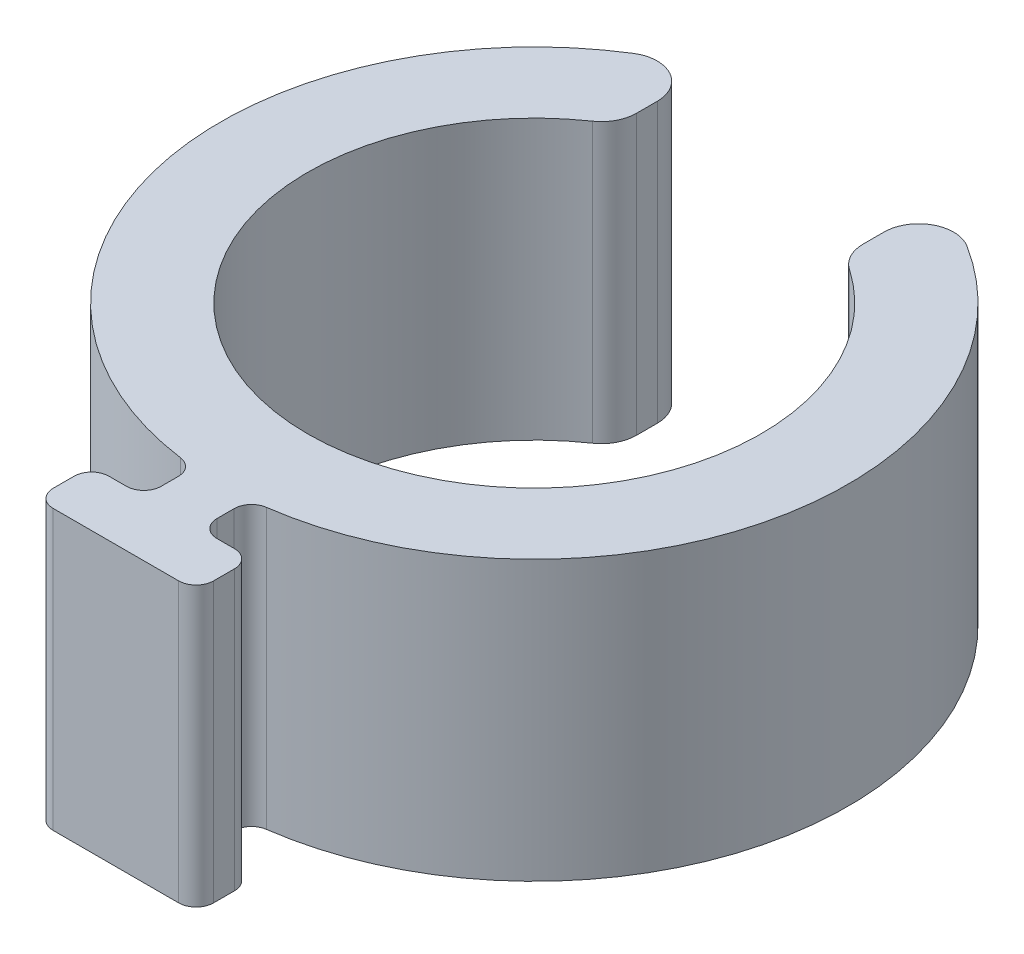
ISO-10303-21;
HEADER;
FILE_DESCRIPTION(('STEP AP214'),'2;1');
FILE_NAME('part.step','',(''),(''),'','','');
FILE_SCHEMA(('AUTOMOTIVE_DESIGN { 1 0 10303 214 1 1 1 1 }'));
ENDSEC;
DATA;
#1=APPLICATION_CONTEXT('core data for automotive mechanical design processes');
#2=APPLICATION_PROTOCOL_DEFINITION('international standard','automotive_design',2000,#1);
#3=PRODUCT_CONTEXT('',#1,'mechanical');
#4=PRODUCT('Part','Part','',(#3));
#5=PRODUCT_RELATED_PRODUCT_CATEGORY('part','',(#4));
#6=PRODUCT_DEFINITION_FORMATION('','',#4);
#7=PRODUCT_DEFINITION_CONTEXT('part definition',#1,'design');
#8=PRODUCT_DEFINITION('design','',#6,#7);
#9=PRODUCT_DEFINITION_SHAPE('','',#8);
#10=(LENGTH_UNIT() NAMED_UNIT(*) SI_UNIT(.MILLI.,.METRE.));
#11=(NAMED_UNIT(*) PLANE_ANGLE_UNIT() SI_UNIT($,.RADIAN.));
#12=(NAMED_UNIT(*) SI_UNIT($,.STERADIAN.) SOLID_ANGLE_UNIT());
#13=UNCERTAINTY_MEASURE_WITH_UNIT(LENGTH_MEASURE(1.E-05),#10,'distance_accuracy_value','');
#14=(GEOMETRIC_REPRESENTATION_CONTEXT(3) GLOBAL_UNCERTAINTY_ASSIGNED_CONTEXT((#13)) GLOBAL_UNIT_ASSIGNED_CONTEXT((#10,
#11,#12)) REPRESENTATION_CONTEXT('',''));
#15=CARTESIAN_POINT('',(0.,0.,0.));
#16=DIRECTION('',(0.,0.,1.));
#17=DIRECTION('',(1.,0.,0.));
#18=AXIS2_PLACEMENT_3D('',#15,#16,#17);
#19=CARTESIAN_POINT('',(0.,8.,0.));
#20=DIRECTION('',(0.,-1.,0.));
#21=DIRECTION('',(0.,0.,-1.));
#22=AXIS2_PLACEMENT_3D('',#19,#20,#21);
#23=CYLINDRICAL_SURFACE('',#22,9.);
#24=CARTESIAN_POINT('',(0.,0.,0.));
#25=DIRECTION('',(0.,1.,0.));
#26=DIRECTION('',(0.,0.,1.));
#27=AXIS2_PLACEMENT_3D('',#24,#25,#26);
#28=CIRCLE('',#27,9.);
#29=CARTESIAN_POINT('',(-4.78125,0.,-7.62493596284585));
#30=VERTEX_POINT('',#29);
#31=CARTESIAN_POINT('',(-1.23157894736842,0.,8.91533584877198));
#32=VERTEX_POINT('',#31);
#33=EDGE_CURVE('E326',#30,#32,#28,.T.);
#34=ORIENTED_EDGE('',*,*,#33,.T.);
#35=DIRECTION('',(0.,-1.,0.));
#36=VECTOR('',#35,1.);
#37=CARTESIAN_POINT('',(-1.23157894736842,8.,8.91533584877199));
#38=LINE('',#37,#36);
#39=CARTESIAN_POINT('',(-1.23157894736842,8.,8.91533584877198));
#40=VERTEX_POINT('',#39);
#41=EDGE_CURVE('E288',#32,#40,#38,.F.);
#42=ORIENTED_EDGE('',*,*,#41,.T.);
#43=CARTESIAN_POINT('',(0.,8.,0.));
#44=DIRECTION('',(0.,1.,0.));
#45=DIRECTION('',(0.,0.,1.));
#46=AXIS2_PLACEMENT_3D('',#43,#44,#45);
#47=CIRCLE('',#46,9.);
#48=CARTESIAN_POINT('',(-4.78125,8.,-7.62493596284585));
#49=VERTEX_POINT('',#48);
#50=EDGE_CURVE('E205',#49,#40,#47,.T.);
#51=ORIENTED_EDGE('',*,*,#50,.F.);
#52=DIRECTION('',(0.,-1.,0.));
#53=VECTOR('',#52,1.);
#54=CARTESIAN_POINT('',(-4.78125,8.,-7.62493596284585));
#55=LINE('',#54,#53);
#56=EDGE_CURVE('E230',#49,#30,#55,.T.);
#57=ORIENTED_EDGE('',*,*,#56,.T.);
#58=EDGE_LOOP('',(#34,#42,#51,#57));
#59=FACE_BOUND('',#58,.T.);
#60=ADVANCED_FACE('F16',(#59),#23,.T.);
#61=CARTESIAN_POINT('',(1.23157894736842,8.,8.91533584877198));
#62=VERTEX_POINT('',#61);
#63=CARTESIAN_POINT('',(4.78125,8.,-7.62493596284585));
#64=VERTEX_POINT('',#63);
#65=EDGE_CURVE('E202',#62,#64,#47,.T.);
#66=ORIENTED_EDGE('',*,*,#65,.F.);
#67=DIRECTION('',(0.,-1.,0.));
#68=VECTOR('',#67,1.);
#69=CARTESIAN_POINT('',(1.23157894736842,8.,8.91533584877199));
#70=LINE('',#69,#68);
#71=CARTESIAN_POINT('',(1.23157894736842,0.,8.91533584877198));
#72=VERTEX_POINT('',#71);
#73=EDGE_CURVE('E290',#62,#72,#70,.T.);
#74=ORIENTED_EDGE('',*,*,#73,.T.);
#75=CARTESIAN_POINT('',(4.78125,0.,-7.62493596284585));
#76=VERTEX_POINT('',#75);
#77=EDGE_CURVE('E208',#72,#76,#28,.T.);
#78=ORIENTED_EDGE('',*,*,#77,.T.);
#79=DIRECTION('',(0.,-1.,0.));
#80=VECTOR('',#79,1.);
#81=CARTESIAN_POINT('',(4.78125,8.,-7.62493596284585));
#82=LINE('',#81,#80);
#83=EDGE_CURVE('E227',#76,#64,#82,.F.);
#84=ORIENTED_EDGE('',*,*,#83,.T.);
#85=EDGE_LOOP('',(#66,#74,#78,#84));
#86=FACE_BOUND('',#85,.T.);
#87=ADVANCED_FACE('F420',(#86),#23,.T.);
#88=CARTESIAN_POINT('',(0.,8.,0.));
#89=DIRECTION('',(0.,1.,0.));
#90=DIRECTION('',(0.,0.,1.));
#91=AXIS2_PLACEMENT_3D('',#88,#89,#90);
#92=PLANE('',#91);
#93=DIRECTION('',(-1.,0.,0.));
#94=VECTOR('',#93,1.);
#95=CARTESIAN_POINT('',(-2.3,8.,10.4));
#96=LINE('',#95,#94);
#97=CARTESIAN_POINT('',(-1.3,8.,10.4));
#98=VERTEX_POINT('',#97);
#99=CARTESIAN_POINT('',(-1.8,8.,10.4));
#100=VERTEX_POINT('',#99);
#101=EDGE_CURVE('E320',#98,#100,#96,.T.);
#102=ORIENTED_EDGE('',*,*,#101,.T.);
#103=CARTESIAN_POINT('',(-1.8,8.,10.9));
#104=DIRECTION('',(0.,1.,0.));
#105=DIRECTION('',(0.,0.,1.));
#106=AXIS2_PLACEMENT_3D('',#103,#104,#105);
#107=CIRCLE('',#106,0.5);
#108=CARTESIAN_POINT('',(-2.3,8.,10.9));
#109=VERTEX_POINT('',#108);
#110=EDGE_CURVE('E261',#100,#109,#107,.T.);
#111=ORIENTED_EDGE('',*,*,#110,.T.);
#112=DIRECTION('',(0.,0.,1.));
#113=VECTOR('',#112,1.);
#114=CARTESIAN_POINT('',(-2.3,8.,12.));
#115=LINE('',#114,#113);
#116=CARTESIAN_POINT('',(-2.3,8.,11.5));
#117=VERTEX_POINT('',#116);
#118=EDGE_CURVE('E343',#109,#117,#115,.T.);
#119=ORIENTED_EDGE('',*,*,#118,.T.);
#120=CARTESIAN_POINT('',(-1.8,8.,11.5));
#121=DIRECTION('',(0.,1.,0.));
#122=DIRECTION('',(0.,0.,1.));
#123=AXIS2_PLACEMENT_3D('',#120,#121,#122);
#124=CIRCLE('',#123,0.5);
#125=CARTESIAN_POINT('',(-1.8,8.,12.));
#126=VERTEX_POINT('',#125);
#127=EDGE_CURVE('E259',#117,#126,#124,.T.);
#128=ORIENTED_EDGE('',*,*,#127,.T.);
#129=DIRECTION('',(1.,0.,0.));
#130=VECTOR('',#129,1.);
#131=CARTESIAN_POINT('',(-2.3,8.,12.));
#132=LINE('',#131,#130);
#133=CARTESIAN_POINT('',(1.8,8.,12.));
#134=VERTEX_POINT('',#133);
#135=EDGE_CURVE('E336',#126,#134,#132,.T.);
#136=ORIENTED_EDGE('',*,*,#135,.T.);
#137=CARTESIAN_POINT('',(1.8,8.,11.5));
#138=DIRECTION('',(0.,1.,0.));
#139=DIRECTION('',(0.,0.,1.));
#140=AXIS2_PLACEMENT_3D('',#137,#138,#139);
#141=CIRCLE('',#140,0.5);
#142=CARTESIAN_POINT('',(2.3,8.,11.5));
#143=VERTEX_POINT('',#142);
#144=EDGE_CURVE('E255',#134,#143,#141,.T.);
#145=ORIENTED_EDGE('',*,*,#144,.T.);
#146=DIRECTION('',(0.,0.,-1.));
#147=VECTOR('',#146,1.);
#148=CARTESIAN_POINT('',(2.3,8.,12.));
#149=LINE('',#148,#147);
#150=CARTESIAN_POINT('',(2.3,8.,10.9));
#151=VERTEX_POINT('',#150);
#152=EDGE_CURVE('E331',#143,#151,#149,.T.);
#153=ORIENTED_EDGE('',*,*,#152,.T.);
#154=CARTESIAN_POINT('',(1.8,8.,10.9));
#155=DIRECTION('',(0.,1.,0.));
#156=DIRECTION('',(0.,0.,1.));
#157=AXIS2_PLACEMENT_3D('',#154,#155,#156);
#158=CIRCLE('',#157,0.5);
#159=CARTESIAN_POINT('',(1.8,8.,10.4));
#160=VERTEX_POINT('',#159);
#161=EDGE_CURVE('E257',#151,#160,#158,.T.);
#162=ORIENTED_EDGE('',*,*,#161,.T.);
#163=DIRECTION('',(-1.,0.,0.));
#164=VECTOR('',#163,1.);
#165=CARTESIAN_POINT('',(0.8,8.,10.4));
#166=LINE('',#165,#164);
#167=CARTESIAN_POINT('',(1.3,8.,10.4));
#168=VERTEX_POINT('',#167);
#169=EDGE_CURVE('E329',#160,#168,#166,.T.);
#170=ORIENTED_EDGE('',*,*,#169,.T.);
#171=CARTESIAN_POINT('',(1.3,8.,9.9));
#172=DIRECTION('',(0.,1.,0.));
#173=DIRECTION('',(0.,0.,1.));
#174=AXIS2_PLACEMENT_3D('',#171,#172,#173);
#175=CIRCLE('',#174,0.5);
#176=CARTESIAN_POINT('',(0.8,8.,9.9));
#177=VERTEX_POINT('',#176);
#178=EDGE_CURVE('E294',#168,#177,#175,.F.);
#179=ORIENTED_EDGE('',*,*,#178,.T.);
#180=DIRECTION('',(0.,0.,-1.));
#181=VECTOR('',#180,1.);
#182=CARTESIAN_POINT('',(0.8,8.,10.4));
#183=LINE('',#182,#181);
#184=CARTESIAN_POINT('',(0.8,8.,9.41063228481487));
#185=VERTEX_POINT('',#184);
#186=EDGE_CURVE('E321',#177,#185,#183,.T.);
#187=ORIENTED_EDGE('',*,*,#186,.T.);
#188=CARTESIAN_POINT('',(1.3,8.,9.41063228481487));
#189=DIRECTION('',(0.,1.,0.));
#190=DIRECTION('',(0.,0.,1.));
#191=AXIS2_PLACEMENT_3D('',#188,#189,#190);
#192=CIRCLE('',#191,0.5);
#193=EDGE_CURVE('E24',#185,#62,#192,.F.);
#194=ORIENTED_EDGE('',*,*,#193,.T.);
#195=ORIENTED_EDGE('',*,*,#65,.T.);
#196=CARTESIAN_POINT('',(4.25,8.,-6.77772085586298));
#197=DIRECTION('',(0.,1.,0.));
#198=DIRECTION('',(0.,0.,1.));
#199=AXIS2_PLACEMENT_3D('',#196,#197,#198);
#200=CIRCLE('',#199,1.);
#201=CARTESIAN_POINT('',(3.25,8.,-6.77772085586298));
#202=VERTEX_POINT('',#201);
#203=EDGE_CURVE('E223',#64,#202,#200,.T.);
#204=ORIENTED_EDGE('',*,*,#203,.T.);
#205=DIRECTION('',(0.,0.,-1.));
#206=VECTOR('',#205,1.);
#207=CARTESIAN_POINT('',(3.25,8.,0.));
#208=LINE('',#207,#206);
#209=CARTESIAN_POINT('',(3.25,8.,-6.17960354715414));
#210=VERTEX_POINT('',#209);
#211=EDGE_CURVE('E432',#210,#202,#208,.T.);
#212=ORIENTED_EDGE('',*,*,#211,.F.);
#213=CARTESIAN_POINT('',(4.25,8.,-6.17960354715414));
#214=DIRECTION('',(0.,1.,0.));
#215=DIRECTION('',(0.,0.,1.));
#216=AXIS2_PLACEMENT_3D('',#213,#214,#215);
#217=CIRCLE('',#216,1.);
#218=CARTESIAN_POINT('',(3.68333333333333,8.,-5.35565640753359));
#219=VERTEX_POINT('',#218);
#220=EDGE_CURVE('E225',#210,#219,#217,.T.);
#221=ORIENTED_EDGE('',*,*,#220,.T.);
#222=CARTESIAN_POINT('',(0.,8.,0.));
#223=DIRECTION('',(0.,1.,0.));
#224=DIRECTION('',(0.,0.,1.));
#225=AXIS2_PLACEMENT_3D('',#222,#223,#224);
#226=CIRCLE('',#225,6.5);
#227=CARTESIAN_POINT('',(-3.68333333333333,8.,-5.35565640753359));
#228=VERTEX_POINT('',#227);
#229=EDGE_CURVE('E198',#228,#219,#226,.T.);
#230=ORIENTED_EDGE('',*,*,#229,.F.);
#231=CARTESIAN_POINT('',(-4.25,8.,-6.17960354715414));
#232=DIRECTION('',(0.,1.,0.));
#233=DIRECTION('',(0.,0.,1.));
#234=AXIS2_PLACEMENT_3D('',#231,#232,#233);
#235=CIRCLE('',#234,1.);
#236=CARTESIAN_POINT('',(-3.25,8.,-6.17960354715414));
#237=VERTEX_POINT('',#236);
#238=EDGE_CURVE('E201',#228,#237,#235,.T.);
#239=ORIENTED_EDGE('',*,*,#238,.T.);
#240=DIRECTION('',(0.,0.,1.));
#241=VECTOR('',#240,1.);
#242=CARTESIAN_POINT('',(-3.25,8.,0.));
#243=LINE('',#242,#241);
#244=CARTESIAN_POINT('',(-3.25,8.,-6.77772085586298));
#245=VERTEX_POINT('',#244);
#246=EDGE_CURVE('E436',#245,#237,#243,.T.);
#247=ORIENTED_EDGE('',*,*,#246,.F.);
#248=CARTESIAN_POINT('',(-4.25,8.,-6.77772085586298));
#249=DIRECTION('',(0.,1.,0.));
#250=DIRECTION('',(0.,0.,1.));
#251=AXIS2_PLACEMENT_3D('',#248,#249,#250);
#252=CIRCLE('',#251,1.);
#253=EDGE_CURVE('E221',#245,#49,#252,.T.);
#254=ORIENTED_EDGE('',*,*,#253,.T.);
#255=ORIENTED_EDGE('',*,*,#50,.T.);
#256=CARTESIAN_POINT('',(-1.3,8.,9.41063228481487));
#257=DIRECTION('',(0.,1.,0.));
#258=DIRECTION('',(0.,0.,1.));
#259=AXIS2_PLACEMENT_3D('',#256,#257,#258);
#260=CIRCLE('',#259,0.5);
#261=CARTESIAN_POINT('',(-0.8,8.,9.41063228481487));
#262=VERTEX_POINT('',#261);
#263=EDGE_CURVE('E302',#40,#262,#260,.F.);
#264=ORIENTED_EDGE('',*,*,#263,.T.);
#265=DIRECTION('',(0.,0.,1.));
#266=VECTOR('',#265,1.);
#267=CARTESIAN_POINT('',(-0.8,8.,10.4));
#268=LINE('',#267,#266);
#269=CARTESIAN_POINT('',(-0.8,8.,9.9));
#270=VERTEX_POINT('',#269);
#271=EDGE_CURVE('E309',#262,#270,#268,.T.);
#272=ORIENTED_EDGE('',*,*,#271,.T.);
#273=CARTESIAN_POINT('',(-1.3,8.,9.9));
#274=DIRECTION('',(0.,1.,0.));
#275=DIRECTION('',(0.,0.,1.));
#276=AXIS2_PLACEMENT_3D('',#273,#274,#275);
#277=CIRCLE('',#276,0.5);
#278=EDGE_CURVE('E298',#270,#98,#277,.F.);
#279=ORIENTED_EDGE('',*,*,#278,.T.);
#280=EDGE_LOOP('',(#102,#111,#119,#128,#136,#145,#153,#162,#170,#179,#187,#194,#195,#204,#212,
#221,#230,#239,#247,#254,#255,#264,#272,#279));
#281=FACE_BOUND('',#280,.T.);
#282=ADVANCED_FACE('F308',(#281),#92,.T.);
#283=CARTESIAN_POINT('',(0.,0.,0.));
#284=DIRECTION('',(0.,1.,0.));
#285=DIRECTION('',(0.,0.,1.));
#286=AXIS2_PLACEMENT_3D('',#283,#284,#285);
#287=PLANE('',#286);
#288=DIRECTION('',(0.,0.,1.));
#289=VECTOR('',#288,1.);
#290=CARTESIAN_POINT('',(-2.3,0.,12.));
#291=LINE('',#290,#289);
#292=CARTESIAN_POINT('',(-2.3,0.,10.9));
#293=VERTEX_POINT('',#292);
#294=CARTESIAN_POINT('',(-2.3,0.,11.5));
#295=VERTEX_POINT('',#294);
#296=EDGE_CURVE('E364',#293,#295,#291,.T.);
#297=ORIENTED_EDGE('',*,*,#296,.F.);
#298=CARTESIAN_POINT('',(-1.8,0.,10.9));
#299=DIRECTION('',(0.,1.,0.));
#300=DIRECTION('',(0.,0.,1.));
#301=AXIS2_PLACEMENT_3D('',#298,#299,#300);
#302=CIRCLE('',#301,0.5);
#303=CARTESIAN_POINT('',(-1.8,0.,10.4));
#304=VERTEX_POINT('',#303);
#305=EDGE_CURVE('E248',#293,#304,#302,.F.);
#306=ORIENTED_EDGE('',*,*,#305,.T.);
#307=DIRECTION('',(-1.,0.,0.));
#308=VECTOR('',#307,1.);
#309=CARTESIAN_POINT('',(-2.3,0.,10.4));
#310=LINE('',#309,#308);
#311=CARTESIAN_POINT('',(-1.3,0.,10.4));
#312=VERTEX_POINT('',#311);
#313=EDGE_CURVE('E366',#312,#304,#310,.T.);
#314=ORIENTED_EDGE('',*,*,#313,.F.);
#315=CARTESIAN_POINT('',(-1.3,0.,9.9));
#316=DIRECTION('',(0.,1.,0.));
#317=DIRECTION('',(0.,0.,1.));
#318=AXIS2_PLACEMENT_3D('',#315,#316,#317);
#319=CIRCLE('',#318,0.5);
#320=CARTESIAN_POINT('',(-0.8,0.,9.9));
#321=VERTEX_POINT('',#320);
#322=EDGE_CURVE('E296',#312,#321,#319,.T.);
#323=ORIENTED_EDGE('',*,*,#322,.T.);
#324=DIRECTION('',(0.,0.,1.));
#325=VECTOR('',#324,1.);
#326=CARTESIAN_POINT('',(-0.8,0.,10.4));
#327=LINE('',#326,#325);
#328=CARTESIAN_POINT('',(-0.8,0.,9.41063228481487));
#329=VERTEX_POINT('',#328);
#330=EDGE_CURVE('E197',#329,#321,#327,.T.);
#331=ORIENTED_EDGE('',*,*,#330,.F.);
#332=CARTESIAN_POINT('',(-1.3,0.,9.41063228481487));
#333=DIRECTION('',(0.,1.,0.));
#334=DIRECTION('',(0.,0.,1.));
#335=AXIS2_PLACEMENT_3D('',#332,#333,#334);
#336=CIRCLE('',#335,0.5);
#337=EDGE_CURVE('E300',#329,#32,#336,.T.);
#338=ORIENTED_EDGE('',*,*,#337,.T.);
#339=ORIENTED_EDGE('',*,*,#33,.F.);
#340=CARTESIAN_POINT('',(-4.25,0.,-6.77772085586298));
#341=DIRECTION('',(0.,1.,0.));
#342=DIRECTION('',(0.,0.,1.));
#343=AXIS2_PLACEMENT_3D('',#340,#341,#342);
#344=CIRCLE('',#343,1.);
#345=CARTESIAN_POINT('',(-3.25,0.,-6.77772085586298));
#346=VERTEX_POINT('',#345);
#347=EDGE_CURVE('E186',#30,#346,#344,.F.);
#348=ORIENTED_EDGE('',*,*,#347,.T.);
#349=DIRECTION('',(0.,0.,1.));
#350=VECTOR('',#349,1.);
#351=CARTESIAN_POINT('',(-3.25,0.,0.));
#352=LINE('',#351,#350);
#353=CARTESIAN_POINT('',(-3.25,0.,-6.17960354715414));
#354=VERTEX_POINT('',#353);
#355=EDGE_CURVE('E182',#346,#354,#352,.T.);
#356=ORIENTED_EDGE('',*,*,#355,.T.);
#357=CARTESIAN_POINT('',(-4.25,0.,-6.17960354715414));
#358=DIRECTION('',(0.,1.,0.));
#359=DIRECTION('',(0.,0.,1.));
#360=AXIS2_PLACEMENT_3D('',#357,#358,#359);
#361=CIRCLE('',#360,1.);
#362=CARTESIAN_POINT('',(-3.68333333333333,0.,-5.35565640753359));
#363=VERTEX_POINT('',#362);
#364=EDGE_CURVE('E176',#354,#363,#361,.F.);
#365=ORIENTED_EDGE('',*,*,#364,.T.);
#366=CARTESIAN_POINT('',(0.,0.,0.));
#367=DIRECTION('',(0.,1.,0.));
#368=DIRECTION('',(0.,0.,1.));
#369=AXIS2_PLACEMENT_3D('',#366,#367,#368);
#370=CIRCLE('',#369,6.5);
#371=CARTESIAN_POINT('',(3.68333333333333,0.,-5.35565640753359));
#372=VERTEX_POINT('',#371);
#373=EDGE_CURVE('E180',#363,#372,#370,.T.);
#374=ORIENTED_EDGE('',*,*,#373,.T.);
#375=CARTESIAN_POINT('',(4.25,0.,-6.17960354715414));
#376=DIRECTION('',(0.,1.,0.));
#377=DIRECTION('',(0.,0.,1.));
#378=AXIS2_PLACEMENT_3D('',#375,#376,#377);
#379=CIRCLE('',#378,1.);
#380=CARTESIAN_POINT('',(3.25,0.,-6.17960354715414));
#381=VERTEX_POINT('',#380);
#382=EDGE_CURVE('E214',#372,#381,#379,.F.);
#383=ORIENTED_EDGE('',*,*,#382,.T.);
#384=DIRECTION('',(0.,0.,-1.));
#385=VECTOR('',#384,1.);
#386=CARTESIAN_POINT('',(3.25,0.,0.));
#387=LINE('',#386,#385);
#388=CARTESIAN_POINT('',(3.25,0.,-6.77772085586298));
#389=VERTEX_POINT('',#388);
#390=EDGE_CURVE('E430',#381,#389,#387,.T.);
#391=ORIENTED_EDGE('',*,*,#390,.T.);
#392=CARTESIAN_POINT('',(4.25,0.,-6.77772085586298));
#393=DIRECTION('',(0.,1.,0.));
#394=DIRECTION('',(0.,0.,1.));
#395=AXIS2_PLACEMENT_3D('',#392,#393,#394);
#396=CIRCLE('',#395,1.);
#397=EDGE_CURVE('E211',#389,#76,#396,.F.);
#398=ORIENTED_EDGE('',*,*,#397,.T.);
#399=ORIENTED_EDGE('',*,*,#77,.F.);
#400=CARTESIAN_POINT('',(1.3,0.,9.41063228481487));
#401=DIRECTION('',(0.,1.,0.));
#402=DIRECTION('',(0.,0.,1.));
#403=AXIS2_PLACEMENT_3D('',#400,#401,#402);
#404=CIRCLE('',#403,0.5);
#405=CARTESIAN_POINT('',(0.8,0.,9.41063228481487));
#406=VERTEX_POINT('',#405);
#407=EDGE_CURVE('E11',#72,#406,#404,.T.);
#408=ORIENTED_EDGE('',*,*,#407,.T.);
#409=DIRECTION('',(0.,0.,-1.));
#410=VECTOR('',#409,1.);
#411=CARTESIAN_POINT('',(0.8,0.,10.4));
#412=LINE('',#411,#410);
#413=CARTESIAN_POINT('',(0.8,0.,9.9));
#414=VERTEX_POINT('',#413);
#415=EDGE_CURVE('E347',#414,#406,#412,.T.);
#416=ORIENTED_EDGE('',*,*,#415,.F.);
#417=CARTESIAN_POINT('',(1.3,0.,9.9));
#418=DIRECTION('',(0.,1.,0.));
#419=DIRECTION('',(0.,0.,1.));
#420=AXIS2_PLACEMENT_3D('',#417,#418,#419);
#421=CIRCLE('',#420,0.5);
#422=CARTESIAN_POINT('',(1.3,0.,10.4));
#423=VERTEX_POINT('',#422);
#424=EDGE_CURVE('E292',#414,#423,#421,.T.);
#425=ORIENTED_EDGE('',*,*,#424,.T.);
#426=DIRECTION('',(-1.,0.,0.));
#427=VECTOR('',#426,1.);
#428=CARTESIAN_POINT('',(0.8,0.,10.4));
#429=LINE('',#428,#427);
#430=CARTESIAN_POINT('',(1.8,0.,10.4));
#431=VERTEX_POINT('',#430);
#432=EDGE_CURVE('E350',#431,#423,#429,.T.);
#433=ORIENTED_EDGE('',*,*,#432,.F.);
#434=CARTESIAN_POINT('',(1.8,0.,10.9));
#435=DIRECTION('',(0.,1.,0.));
#436=DIRECTION('',(0.,0.,1.));
#437=AXIS2_PLACEMENT_3D('',#434,#435,#436);
#438=CIRCLE('',#437,0.5);
#439=CARTESIAN_POINT('',(2.3,0.,10.9));
#440=VERTEX_POINT('',#439);
#441=EDGE_CURVE('E244',#431,#440,#438,.F.);
#442=ORIENTED_EDGE('',*,*,#441,.T.);
#443=DIRECTION('',(0.,0.,-1.));
#444=VECTOR('',#443,1.);
#445=CARTESIAN_POINT('',(2.3,0.,12.));
#446=LINE('',#445,#444);
#447=CARTESIAN_POINT('',(2.3,0.,11.5));
#448=VERTEX_POINT('',#447);
#449=EDGE_CURVE('E355',#448,#440,#446,.T.);
#450=ORIENTED_EDGE('',*,*,#449,.F.);
#451=CARTESIAN_POINT('',(1.8,0.,11.5));
#452=DIRECTION('',(0.,1.,0.));
#453=DIRECTION('',(0.,0.,1.));
#454=AXIS2_PLACEMENT_3D('',#451,#452,#453);
#455=CIRCLE('',#454,0.5);
#456=CARTESIAN_POINT('',(1.8,0.,12.));
#457=VERTEX_POINT('',#456);
#458=EDGE_CURVE('E242',#448,#457,#455,.F.);
#459=ORIENTED_EDGE('',*,*,#458,.T.);
#460=DIRECTION('',(1.,0.,0.));
#461=VECTOR('',#460,1.);
#462=CARTESIAN_POINT('',(-2.3,0.,12.));
#463=LINE('',#462,#461);
#464=CARTESIAN_POINT('',(-1.8,0.,12.));
#465=VERTEX_POINT('',#464);
#466=EDGE_CURVE('E361',#465,#457,#463,.T.);
#467=ORIENTED_EDGE('',*,*,#466,.F.);
#468=CARTESIAN_POINT('',(-1.8,0.,11.5));
#469=DIRECTION('',(0.,1.,0.));
#470=DIRECTION('',(0.,0.,1.));
#471=AXIS2_PLACEMENT_3D('',#468,#469,#470);
#472=CIRCLE('',#471,0.5);
#473=EDGE_CURVE('E246',#465,#295,#472,.F.);
#474=ORIENTED_EDGE('',*,*,#473,.T.);
#475=EDGE_LOOP('',(#297,#306,#314,#323,#331,#338,#339,#348,#356,#365,#374,#383,#391,#398,#399,
#408,#416,#425,#433,#442,#450,#459,#467,#474));
#476=FACE_BOUND('',#475,.T.);
#477=ADVANCED_FACE('F179',(#476),#287,.F.);
#478=CARTESIAN_POINT('',(-0.8,20.8514590611339,10.4));
#479=DIRECTION('',(1.,0.,0.));
#480=DIRECTION('',(0.,0.,-1.));
#481=AXIS2_PLACEMENT_3D('',#478,#479,#480);
#482=PLANE('',#481);
#483=ORIENTED_EDGE('',*,*,#330,.T.);
#484=DIRECTION('',(0.,-1.,0.));
#485=VECTOR('',#484,1.);
#486=CARTESIAN_POINT('',(-0.8,8.,9.9));
#487=LINE('',#486,#485);
#488=EDGE_CURVE('E286',#321,#270,#487,.F.);
#489=ORIENTED_EDGE('',*,*,#488,.T.);
#490=ORIENTED_EDGE('',*,*,#271,.F.);
#491=DIRECTION('',(0.,1.,0.));
#492=VECTOR('',#491,1.);
#493=CARTESIAN_POINT('',(-0.8,0.,9.41063228481487));
#494=LINE('',#493,#492);
#495=EDGE_CURVE('E283',#262,#329,#494,.F.);
#496=ORIENTED_EDGE('',*,*,#495,.T.);
#497=EDGE_LOOP('',(#483,#489,#490,#496));
#498=FACE_BOUND('',#497,.T.);
#499=ADVANCED_FACE('F317',(#498),#482,.F.);
#500=CARTESIAN_POINT('',(0.8,20.8514590611339,10.4));
#501=DIRECTION('',(-1.,0.,0.));
#502=DIRECTION('',(0.,0.,1.));
#503=AXIS2_PLACEMENT_3D('',#500,#501,#502);
#504=PLANE('',#503);
#505=ORIENTED_EDGE('',*,*,#186,.F.);
#506=DIRECTION('',(0.,-1.,0.));
#507=VECTOR('',#506,1.);
#508=CARTESIAN_POINT('',(0.8,0.,9.9));
#509=LINE('',#508,#507);
#510=EDGE_CURVE('E280',#177,#414,#509,.T.);
#511=ORIENTED_EDGE('',*,*,#510,.T.);
#512=ORIENTED_EDGE('',*,*,#415,.T.);
#513=DIRECTION('',(0.,1.,0.));
#514=VECTOR('',#513,1.);
#515=CARTESIAN_POINT('',(0.8,8.,9.41063228481487));
#516=LINE('',#515,#514);
#517=EDGE_CURVE('E278',#406,#185,#516,.T.);
#518=ORIENTED_EDGE('',*,*,#517,.T.);
#519=EDGE_LOOP('',(#505,#511,#512,#518));
#520=FACE_BOUND('',#519,.T.);
#521=ADVANCED_FACE('F413',(#520),#504,.F.);
#522=CARTESIAN_POINT('',(-2.3,20.8514590611339,10.4));
#523=DIRECTION('',(0.,0.,1.));
#524=DIRECTION('',(1.,0.,0.));
#525=AXIS2_PLACEMENT_3D('',#522,#523,#524);
#526=PLANE('',#525);
#527=ORIENTED_EDGE('',*,*,#313,.T.);
#528=DIRECTION('',(0.,-1.,0.));
#529=VECTOR('',#528,1.);
#530=CARTESIAN_POINT('',(-1.8,20.8514590611339,10.4));
#531=LINE('',#530,#529);
#532=EDGE_CURVE('E253',#304,#100,#531,.F.);
#533=ORIENTED_EDGE('',*,*,#532,.T.);
#534=ORIENTED_EDGE('',*,*,#101,.F.);
#535=DIRECTION('',(0.,-1.,0.));
#536=VECTOR('',#535,1.);
#537=CARTESIAN_POINT('',(-1.3,0.,10.4));
#538=LINE('',#537,#536);
#539=EDGE_CURVE('E250',#98,#312,#538,.T.);
#540=ORIENTED_EDGE('',*,*,#539,.T.);
#541=EDGE_LOOP('',(#527,#533,#534,#540));
#542=FACE_BOUND('',#541,.T.);
#543=ADVANCED_FACE('F376',(#542),#526,.F.);
#544=CARTESIAN_POINT('',(-2.3,20.8514590611339,12.));
#545=DIRECTION('',(1.,0.,0.));
#546=DIRECTION('',(0.,0.,-1.));
#547=AXIS2_PLACEMENT_3D('',#544,#545,#546);
#548=PLANE('',#547);
#549=ORIENTED_EDGE('',*,*,#118,.F.);
#550=DIRECTION('',(0.,-1.,0.));
#551=VECTOR('',#550,1.);
#552=CARTESIAN_POINT('',(-2.3,20.8514590611339,10.9));
#553=LINE('',#552,#551);
#554=EDGE_CURVE('E239',#109,#293,#553,.T.);
#555=ORIENTED_EDGE('',*,*,#554,.T.);
#556=ORIENTED_EDGE('',*,*,#296,.T.);
#557=DIRECTION('',(0.,-1.,0.));
#558=VECTOR('',#557,1.);
#559=CARTESIAN_POINT('',(-2.3,20.8514590611339,11.5));
#560=LINE('',#559,#558);
#561=EDGE_CURVE('E237',#295,#117,#560,.F.);
#562=ORIENTED_EDGE('',*,*,#561,.T.);
#563=EDGE_LOOP('',(#549,#555,#556,#562));
#564=FACE_BOUND('',#563,.T.);
#565=ADVANCED_FACE('F383',(#564),#548,.F.);
#566=CARTESIAN_POINT('',(-2.3,20.8514590611339,12.));
#567=DIRECTION('',(0.,0.,-1.));
#568=DIRECTION('',(-1.,0.,0.));
#569=AXIS2_PLACEMENT_3D('',#566,#567,#568);
#570=PLANE('',#569);
#571=ORIENTED_EDGE('',*,*,#135,.F.);
#572=DIRECTION('',(0.,-1.,0.));
#573=VECTOR('',#572,1.);
#574=CARTESIAN_POINT('',(-1.8,20.8514590611339,12.));
#575=LINE('',#574,#573);
#576=EDGE_CURVE('E265',#126,#465,#575,.T.);
#577=ORIENTED_EDGE('',*,*,#576,.T.);
#578=ORIENTED_EDGE('',*,*,#466,.T.);
#579=DIRECTION('',(0.,-1.,0.));
#580=VECTOR('',#579,1.);
#581=CARTESIAN_POINT('',(1.8,20.8514590611339,12.));
#582=LINE('',#581,#580);
#583=EDGE_CURVE('E263',#457,#134,#582,.F.);
#584=ORIENTED_EDGE('',*,*,#583,.T.);
#585=EDGE_LOOP('',(#571,#577,#578,#584));
#586=FACE_BOUND('',#585,.T.);
#587=ADVANCED_FACE('F391',(#586),#570,.F.);
#588=CARTESIAN_POINT('',(2.3,20.8514590611339,12.));
#589=DIRECTION('',(-1.,0.,0.));
#590=DIRECTION('',(0.,0.,1.));
#591=AXIS2_PLACEMENT_3D('',#588,#589,#590);
#592=PLANE('',#591);
#593=ORIENTED_EDGE('',*,*,#449,.T.);
#594=DIRECTION('',(0.,-1.,0.));
#595=VECTOR('',#594,1.);
#596=CARTESIAN_POINT('',(2.3,20.8514590611339,10.9));
#597=LINE('',#596,#595);
#598=EDGE_CURVE('E276',#440,#151,#597,.F.);
#599=ORIENTED_EDGE('',*,*,#598,.T.);
#600=ORIENTED_EDGE('',*,*,#152,.F.);
#601=DIRECTION('',(0.,-1.,0.));
#602=VECTOR('',#601,1.);
#603=CARTESIAN_POINT('',(2.3,20.8514590611339,11.5));
#604=LINE('',#603,#602);
#605=EDGE_CURVE('E273',#143,#448,#604,.T.);
#606=ORIENTED_EDGE('',*,*,#605,.T.);
#607=EDGE_LOOP('',(#593,#599,#600,#606));
#608=FACE_BOUND('',#607,.T.);
#609=ADVANCED_FACE('F400',(#608),#592,.F.);
#610=CARTESIAN_POINT('',(0.8,20.8514590611339,10.4));
#611=DIRECTION('',(0.,0.,1.));
#612=DIRECTION('',(1.,0.,0.));
#613=AXIS2_PLACEMENT_3D('',#610,#611,#612);
#614=PLANE('',#613);
#615=ORIENTED_EDGE('',*,*,#169,.F.);
#616=DIRECTION('',(0.,-1.,0.));
#617=VECTOR('',#616,1.);
#618=CARTESIAN_POINT('',(1.8,20.8514590611339,10.4));
#619=LINE('',#618,#617);
#620=EDGE_CURVE('E270',#160,#431,#619,.T.);
#621=ORIENTED_EDGE('',*,*,#620,.T.);
#622=ORIENTED_EDGE('',*,*,#432,.T.);
#623=DIRECTION('',(0.,-1.,0.));
#624=VECTOR('',#623,1.);
#625=CARTESIAN_POINT('',(1.3,8.,10.4));
#626=LINE('',#625,#624);
#627=EDGE_CURVE('E268',#423,#168,#626,.F.);
#628=ORIENTED_EDGE('',*,*,#627,.T.);
#629=EDGE_LOOP('',(#615,#621,#622,#628));
#630=FACE_BOUND('',#629,.T.);
#631=ADVANCED_FACE('F407',(#630),#614,.F.);
#632=CARTESIAN_POINT('',(0.,0.,0.));
#633=DIRECTION('',(0.,1.,0.));
#634=DIRECTION('',(0.,0.,1.));
#635=AXIS2_PLACEMENT_3D('',#632,#633,#634);
#636=CYLINDRICAL_SURFACE('',#635,6.5);
#637=ORIENTED_EDGE('',*,*,#229,.T.);
#638=DIRECTION('',(0.,1.,0.));
#639=VECTOR('',#638,1.);
#640=CARTESIAN_POINT('',(3.68333333333333,0.,-5.35565640753359));
#641=LINE('',#640,#639);
#642=EDGE_CURVE('E187',#219,#372,#641,.F.);
#643=ORIENTED_EDGE('',*,*,#642,.T.);
#644=ORIENTED_EDGE('',*,*,#373,.F.);
#645=DIRECTION('',(0.,1.,0.));
#646=VECTOR('',#645,1.);
#647=CARTESIAN_POINT('',(-3.68333333333333,0.,-5.35565640753359));
#648=LINE('',#647,#646);
#649=EDGE_CURVE('E194',#363,#228,#648,.T.);
#650=ORIENTED_EDGE('',*,*,#649,.T.);
#651=EDGE_LOOP('',(#637,#643,#644,#650));
#652=FACE_BOUND('',#651,.T.);
#653=ADVANCED_FACE('F193',(#652),#636,.F.);
#654=CARTESIAN_POINT('',(3.25,0.,0.));
#655=DIRECTION('',(1.,0.,0.));
#656=DIRECTION('',(0.,0.,-1.));
#657=AXIS2_PLACEMENT_3D('',#654,#655,#656);
#658=PLANE('',#657);
#659=ORIENTED_EDGE('',*,*,#390,.F.);
#660=DIRECTION('',(0.,1.,0.));
#661=VECTOR('',#660,1.);
#662=CARTESIAN_POINT('',(3.25,0.,-6.17960354715414));
#663=LINE('',#662,#661);
#664=EDGE_CURVE('E218',#381,#210,#663,.T.);
#665=ORIENTED_EDGE('',*,*,#664,.T.);
#666=ORIENTED_EDGE('',*,*,#211,.T.);
#667=DIRECTION('',(0.,-1.,0.));
#668=VECTOR('',#667,1.);
#669=CARTESIAN_POINT('',(3.25,0.,-6.77772085586298));
#670=LINE('',#669,#668);
#671=EDGE_CURVE('E216',#202,#389,#670,.T.);
#672=ORIENTED_EDGE('',*,*,#671,.T.);
#673=EDGE_LOOP('',(#659,#665,#666,#672));
#674=FACE_BOUND('',#673,.T.);
#675=ADVANCED_FACE('F429',(#674),#658,.F.);
#676=CARTESIAN_POINT('',(-3.25,0.,0.));
#677=DIRECTION('',(-1.,0.,0.));
#678=DIRECTION('',(0.,0.,1.));
#679=AXIS2_PLACEMENT_3D('',#676,#677,#678);
#680=PLANE('',#679);
#681=ORIENTED_EDGE('',*,*,#355,.F.);
#682=DIRECTION('',(0.,-1.,0.));
#683=VECTOR('',#682,1.);
#684=CARTESIAN_POINT('',(-3.25,0.,-6.77772085586298));
#685=LINE('',#684,#683);
#686=EDGE_CURVE('E235',#346,#245,#685,.F.);
#687=ORIENTED_EDGE('',*,*,#686,.T.);
#688=ORIENTED_EDGE('',*,*,#246,.T.);
#689=DIRECTION('',(0.,1.,0.));
#690=VECTOR('',#689,1.);
#691=CARTESIAN_POINT('',(-3.25,0.,-6.17960354715414));
#692=LINE('',#691,#690);
#693=EDGE_CURVE('E233',#237,#354,#692,.F.);
#694=ORIENTED_EDGE('',*,*,#693,.T.);
#695=EDGE_LOOP('',(#681,#687,#688,#694));
#696=FACE_BOUND('',#695,.T.);
#697=ADVANCED_FACE('F441',(#696),#680,.F.);
#698=CARTESIAN_POINT('',(4.25,0.,-6.17960354715414));
#699=DIRECTION('',(0.,1.,0.));
#700=DIRECTION('',(0.,0.,1.));
#701=AXIS2_PLACEMENT_3D('',#698,#699,#700);
#702=CYLINDRICAL_SURFACE('',#701,1.);
#703=ORIENTED_EDGE('',*,*,#220,.F.);
#704=ORIENTED_EDGE('',*,*,#664,.F.);
#705=ORIENTED_EDGE('',*,*,#382,.F.);
#706=ORIENTED_EDGE('',*,*,#642,.F.);
#707=EDGE_LOOP('',(#703,#704,#705,#706));
#708=FACE_BOUND('',#707,.T.);
#709=ADVANCED_FACE('F454',(#708),#702,.T.);
#710=CARTESIAN_POINT('',(4.25,8.,-6.77772085586298));
#711=DIRECTION('',(0.,-1.,0.));
#712=DIRECTION('',(0.,0.,-1.));
#713=AXIS2_PLACEMENT_3D('',#710,#711,#712);
#714=CYLINDRICAL_SURFACE('',#713,1.);
#715=ORIENTED_EDGE('',*,*,#397,.F.);
#716=ORIENTED_EDGE('',*,*,#671,.F.);
#717=ORIENTED_EDGE('',*,*,#203,.F.);
#718=ORIENTED_EDGE('',*,*,#83,.F.);
#719=EDGE_LOOP('',(#715,#716,#717,#718));
#720=FACE_BOUND('',#719,.T.);
#721=ADVANCED_FACE('F426',(#720),#714,.T.);
#722=CARTESIAN_POINT('',(-4.25,8.,-6.77772085586298));
#723=DIRECTION('',(0.,-1.,0.));
#724=DIRECTION('',(0.,0.,-1.));
#725=AXIS2_PLACEMENT_3D('',#722,#723,#724);
#726=CYLINDRICAL_SURFACE('',#725,1.);
#727=ORIENTED_EDGE('',*,*,#253,.F.);
#728=ORIENTED_EDGE('',*,*,#686,.F.);
#729=ORIENTED_EDGE('',*,*,#347,.F.);
#730=ORIENTED_EDGE('',*,*,#56,.F.);
#731=EDGE_LOOP('',(#727,#728,#729,#730));
#732=FACE_BOUND('',#731,.T.);
#733=ADVANCED_FACE('F445',(#732),#726,.T.);
#734=CARTESIAN_POINT('',(-4.25,0.,-6.17960354715414));
#735=DIRECTION('',(0.,1.,0.));
#736=DIRECTION('',(0.,0.,1.));
#737=AXIS2_PLACEMENT_3D('',#734,#735,#736);
#738=CYLINDRICAL_SURFACE('',#737,1.);
#739=ORIENTED_EDGE('',*,*,#364,.F.);
#740=ORIENTED_EDGE('',*,*,#693,.F.);
#741=ORIENTED_EDGE('',*,*,#238,.F.);
#742=ORIENTED_EDGE('',*,*,#649,.F.);
#743=EDGE_LOOP('',(#739,#740,#741,#742));
#744=FACE_BOUND('',#743,.T.);
#745=ADVANCED_FACE('F200',(#744),#738,.T.);
#746=CARTESIAN_POINT('',(-1.8,20.8514590611339,10.9));
#747=DIRECTION('',(0.,-1.,0.));
#748=DIRECTION('',(0.,0.,-1.));
#749=AXIS2_PLACEMENT_3D('',#746,#747,#748);
#750=CYLINDRICAL_SURFACE('',#749,0.5);
#751=ORIENTED_EDGE('',*,*,#110,.F.);
#752=ORIENTED_EDGE('',*,*,#532,.F.);
#753=ORIENTED_EDGE('',*,*,#305,.F.);
#754=ORIENTED_EDGE('',*,*,#554,.F.);
#755=EDGE_LOOP('',(#751,#752,#753,#754));
#756=FACE_BOUND('',#755,.T.);
#757=ADVANCED_FACE('F378',(#756),#750,.T.);
#758=CARTESIAN_POINT('',(-1.8,20.8514590611339,11.5));
#759=DIRECTION('',(0.,-1.,0.));
#760=DIRECTION('',(0.,0.,-1.));
#761=AXIS2_PLACEMENT_3D('',#758,#759,#760);
#762=CYLINDRICAL_SURFACE('',#761,0.5);
#763=ORIENTED_EDGE('',*,*,#127,.F.);
#764=ORIENTED_EDGE('',*,*,#561,.F.);
#765=ORIENTED_EDGE('',*,*,#473,.F.);
#766=ORIENTED_EDGE('',*,*,#576,.F.);
#767=EDGE_LOOP('',(#763,#764,#765,#766));
#768=FACE_BOUND('',#767,.T.);
#769=ADVANCED_FACE('F386',(#768),#762,.T.);
#770=CARTESIAN_POINT('',(1.8,20.8514590611339,10.9));
#771=DIRECTION('',(0.,-1.,0.));
#772=DIRECTION('',(0.,0.,-1.));
#773=AXIS2_PLACEMENT_3D('',#770,#771,#772);
#774=CYLINDRICAL_SURFACE('',#773,0.5);
#775=ORIENTED_EDGE('',*,*,#161,.F.);
#776=ORIENTED_EDGE('',*,*,#598,.F.);
#777=ORIENTED_EDGE('',*,*,#441,.F.);
#778=ORIENTED_EDGE('',*,*,#620,.F.);
#779=EDGE_LOOP('',(#775,#776,#777,#778));
#780=FACE_BOUND('',#779,.T.);
#781=ADVANCED_FACE('F404',(#780),#774,.T.);
#782=CARTESIAN_POINT('',(1.8,20.8514590611339,11.5));
#783=DIRECTION('',(0.,-1.,0.));
#784=DIRECTION('',(0.,0.,-1.));
#785=AXIS2_PLACEMENT_3D('',#782,#783,#784);
#786=CYLINDRICAL_SURFACE('',#785,0.5);
#787=ORIENTED_EDGE('',*,*,#144,.F.);
#788=ORIENTED_EDGE('',*,*,#583,.F.);
#789=ORIENTED_EDGE('',*,*,#458,.F.);
#790=ORIENTED_EDGE('',*,*,#605,.F.);
#791=EDGE_LOOP('',(#787,#788,#789,#790));
#792=FACE_BOUND('',#791,.T.);
#793=ADVANCED_FACE('F395',(#792),#786,.T.);
#794=CARTESIAN_POINT('',(1.3,20.8514590611339,9.9));
#795=DIRECTION('',(0.,1.,0.));
#796=DIRECTION('',(0.,0.,1.));
#797=AXIS2_PLACEMENT_3D('',#794,#795,#796);
#798=CYLINDRICAL_SURFACE('',#797,0.5);
#799=ORIENTED_EDGE('',*,*,#178,.F.);
#800=ORIENTED_EDGE('',*,*,#627,.F.);
#801=ORIENTED_EDGE('',*,*,#424,.F.);
#802=ORIENTED_EDGE('',*,*,#510,.F.);
#803=EDGE_LOOP('',(#799,#800,#801,#802));
#804=FACE_BOUND('',#803,.T.);
#805=ADVANCED_FACE('F411',(#804),#798,.F.);
#806=CARTESIAN_POINT('',(-1.3,20.8514590611339,9.9));
#807=DIRECTION('',(0.,1.,0.));
#808=DIRECTION('',(0.,0.,1.));
#809=AXIS2_PLACEMENT_3D('',#806,#807,#808);
#810=CYLINDRICAL_SURFACE('',#809,0.5);
#811=ORIENTED_EDGE('',*,*,#278,.F.);
#812=ORIENTED_EDGE('',*,*,#488,.F.);
#813=ORIENTED_EDGE('',*,*,#322,.F.);
#814=ORIENTED_EDGE('',*,*,#539,.F.);
#815=EDGE_LOOP('',(#811,#812,#813,#814));
#816=FACE_BOUND('',#815,.T.);
#817=ADVANCED_FACE('F372',(#816),#810,.F.);
#818=CARTESIAN_POINT('',(-1.3,8.,9.41063228481487));
#819=DIRECTION('',(0.,-1.,0.));
#820=DIRECTION('',(0.,0.,-1.));
#821=AXIS2_PLACEMENT_3D('',#818,#819,#820);
#822=CYLINDRICAL_SURFACE('',#821,0.5);
#823=ORIENTED_EDGE('',*,*,#263,.F.);
#824=ORIENTED_EDGE('',*,*,#41,.F.);
#825=ORIENTED_EDGE('',*,*,#337,.F.);
#826=ORIENTED_EDGE('',*,*,#495,.F.);
#827=EDGE_LOOP('',(#823,#824,#825,#826));
#828=FACE_BOUND('',#827,.T.);
#829=ADVANCED_FACE('F323',(#828),#822,.F.);
#830=CARTESIAN_POINT('',(1.3,8.,9.41063228481487));
#831=DIRECTION('',(0.,-1.,0.));
#832=DIRECTION('',(0.,0.,-1.));
#833=AXIS2_PLACEMENT_3D('',#830,#831,#832);
#834=CYLINDRICAL_SURFACE('',#833,0.5);
#835=ORIENTED_EDGE('',*,*,#407,.F.);
#836=ORIENTED_EDGE('',*,*,#73,.F.);
#837=ORIENTED_EDGE('',*,*,#193,.F.);
#838=ORIENTED_EDGE('',*,*,#517,.F.);
#839=EDGE_LOOP('',(#835,#836,#837,#838));
#840=FACE_BOUND('',#839,.T.);
#841=ADVANCED_FACE('F18',(#840),#834,.F.);
#842=CLOSED_SHELL('',(#60,#87,#282,#477,#499,#521,#543,#565,#587,#609,#631,#653,#675,#697,#709,
#721,#733,#745,#757,#769,#781,#793,#805,#817,#829,#841));
#843=MANIFOLD_SOLID_BREP('B1',#842);
#844=ADVANCED_BREP_SHAPE_REPRESENTATION('',(#18,#843),#14);
#845=SHAPE_DEFINITION_REPRESENTATION(#9,#844);
ENDSEC;
END-ISO-10303-21;
